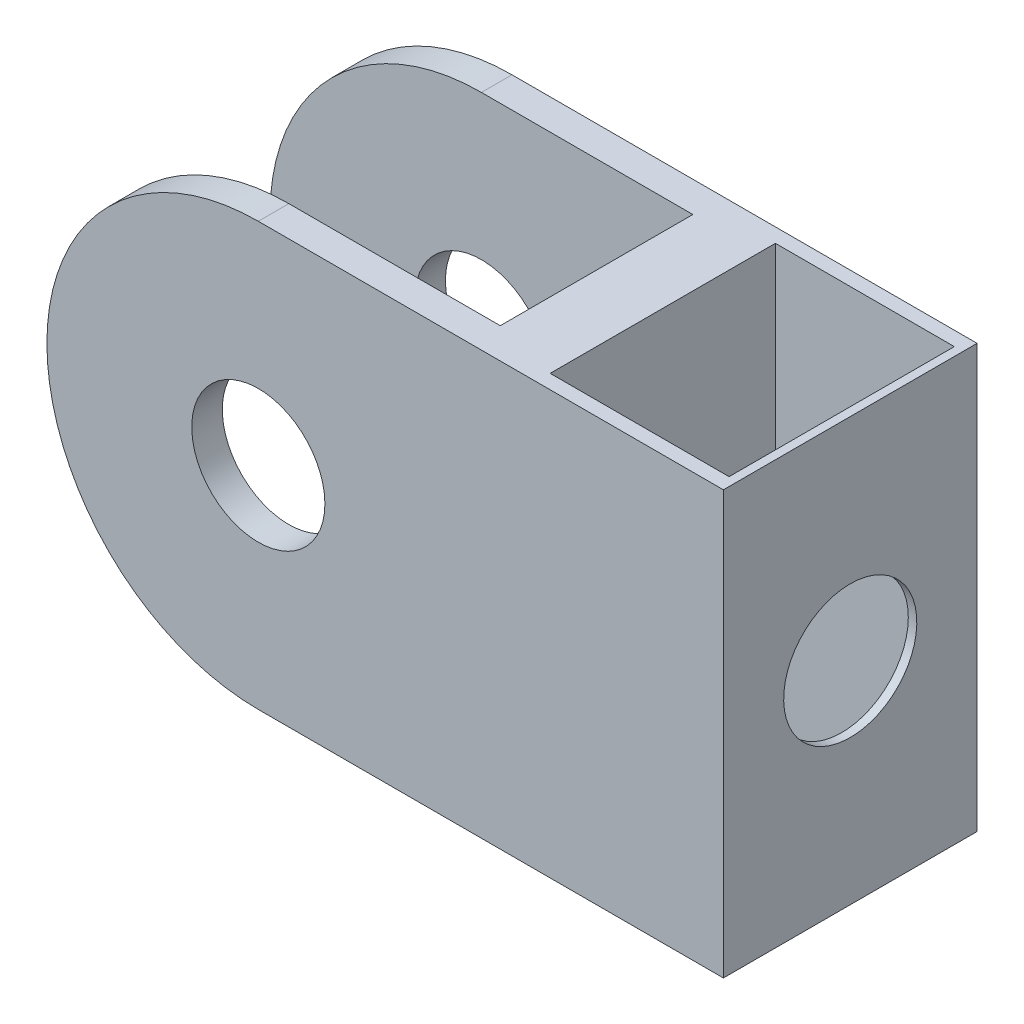
ISO-10303-21;
HEADER;
FILE_DESCRIPTION(('STEP AP214'),'2;1');
FILE_NAME('part.step','',(''),(''),'','','');
FILE_SCHEMA(('AUTOMOTIVE_DESIGN { 1 0 10303 214 1 1 1 1 }'));
ENDSEC;
DATA;
#1=APPLICATION_CONTEXT('core data for automotive mechanical design processes');
#2=APPLICATION_PROTOCOL_DEFINITION('international standard','automotive_design',2000,#1);
#3=PRODUCT_CONTEXT('',#1,'mechanical');
#4=PRODUCT('Part','Part','',(#3));
#5=PRODUCT_RELATED_PRODUCT_CATEGORY('part','',(#4));
#6=PRODUCT_DEFINITION_FORMATION('','',#4);
#7=PRODUCT_DEFINITION_CONTEXT('part definition',#1,'design');
#8=PRODUCT_DEFINITION('design','',#6,#7);
#9=PRODUCT_DEFINITION_SHAPE('','',#8);
#10=(LENGTH_UNIT() NAMED_UNIT(*) SI_UNIT(.MILLI.,.METRE.));
#11=(NAMED_UNIT(*) PLANE_ANGLE_UNIT() SI_UNIT($,.RADIAN.));
#12=(NAMED_UNIT(*) SI_UNIT($,.STERADIAN.) SOLID_ANGLE_UNIT());
#13=UNCERTAINTY_MEASURE_WITH_UNIT(LENGTH_MEASURE(1.E-05),#10,'distance_accuracy_value','');
#14=(GEOMETRIC_REPRESENTATION_CONTEXT(3) GLOBAL_UNCERTAINTY_ASSIGNED_CONTEXT((#13)) GLOBAL_UNIT_ASSIGNED_CONTEXT((#10,
#11,#12)) REPRESENTATION_CONTEXT('',''));
#15=CARTESIAN_POINT('',(0.,0.,0.));
#16=DIRECTION('',(0.,0.,1.));
#17=DIRECTION('',(1.,0.,0.));
#18=AXIS2_PLACEMENT_3D('',#15,#16,#17);
#19=CARTESIAN_POINT('',(0.,0.,15.24));
#20=DIRECTION('',(0.,0.,-1.));
#21=DIRECTION('',(-1.,0.,0.));
#22=AXIS2_PLACEMENT_3D('',#19,#20,#21);
#23=CYLINDRICAL_SURFACE('',#22,12.7);
#24=CARTESIAN_POINT('',(0.,0.,1.83515));
#25=DIRECTION('',(0.,0.,-1.));
#26=DIRECTION('',(-1.,0.,0.));
#27=AXIS2_PLACEMENT_3D('',#24,#25,#26);
#28=CIRCLE('',#27,12.7);
#29=CARTESIAN_POINT('',(0.,-12.7,1.83515));
#30=VERTEX_POINT('',#29);
#31=CARTESIAN_POINT('',(0.,12.7,1.83515));
#32=VERTEX_POINT('',#31);
#33=EDGE_CURVE('E195',#30,#32,#28,.T.);
#34=ORIENTED_EDGE('',*,*,#33,.T.);
#35=DIRECTION('',(0.,0.,-1.));
#36=VECTOR('',#35,1.);
#37=CARTESIAN_POINT('',(0.,12.7,15.24));
#38=LINE('',#37,#36);
#39=CARTESIAN_POINT('',(0.,12.7,0.));
#40=VERTEX_POINT('',#39);
#41=EDGE_CURVE('E214',#32,#40,#38,.T.);
#42=ORIENTED_EDGE('',*,*,#41,.T.);
#43=CARTESIAN_POINT('',(0.,0.,0.));
#44=DIRECTION('',(0.,0.,1.));
#45=DIRECTION('',(1.,0.,0.));
#46=AXIS2_PLACEMENT_3D('',#43,#44,#45);
#47=CIRCLE('',#46,12.7);
#48=CARTESIAN_POINT('',(0.,-12.7,0.));
#49=VERTEX_POINT('',#48);
#50=EDGE_CURVE('E201',#40,#49,#47,.T.);
#51=ORIENTED_EDGE('',*,*,#50,.T.);
#52=DIRECTION('',(0.,0.,-1.));
#53=VECTOR('',#52,1.);
#54=CARTESIAN_POINT('',(0.,-12.7,15.24));
#55=LINE('',#54,#53);
#56=EDGE_CURVE('E48',#30,#49,#55,.T.);
#57=ORIENTED_EDGE('',*,*,#56,.F.);
#58=EDGE_LOOP('',(#34,#42,#51,#57));
#59=FACE_BOUND('',#58,.T.);
#60=ADVANCED_FACE('F39',(#59),#23,.T.);
#61=CARTESIAN_POINT('',(0.,0.,15.24));
#62=DIRECTION('',(0.,0.,-1.));
#63=DIRECTION('',(-1.,0.,0.));
#64=AXIS2_PLACEMENT_3D('',#61,#62,#63);
#65=CYLINDRICAL_SURFACE('',#64,4.);
#66=CARTESIAN_POINT('',(0.,0.,1.83515));
#67=DIRECTION('',(0.,0.,-1.));
#68=DIRECTION('',(-1.,0.,0.));
#69=AXIS2_PLACEMENT_3D('',#66,#67,#68);
#70=CIRCLE('',#69,4.);
#71=CARTESIAN_POINT('',(-4.,0.,1.83515));
#72=VERTEX_POINT('',#71);
#73=EDGE_CURVE('E194',#72,#72,#70,.T.);
#74=ORIENTED_EDGE('',*,*,#73,.F.);
#75=EDGE_LOOP('',(#74));
#76=FACE_BOUND('',#75,.T.);
#77=CARTESIAN_POINT('',(0.,0.,0.));
#78=DIRECTION('',(0.,0.,1.));
#79=DIRECTION('',(1.,0.,0.));
#80=AXIS2_PLACEMENT_3D('',#77,#78,#79);
#81=CIRCLE('',#80,4.);
#82=CARTESIAN_POINT('',(4.,0.,0.));
#83=VERTEX_POINT('',#82);
#84=EDGE_CURVE('E197',#83,#83,#81,.T.);
#85=ORIENTED_EDGE('',*,*,#84,.F.);
#86=EDGE_LOOP('',(#85));
#87=FACE_BOUND('',#86,.T.);
#88=ADVANCED_FACE('F239',(#76,#87),#65,.F.);
#89=CARTESIAN_POINT('',(0.,0.,15.24));
#90=DIRECTION('',(0.,0.,1.));
#91=DIRECTION('',(1.,0.,0.));
#92=AXIS2_PLACEMENT_3D('',#89,#90,#91);
#93=PLANE('',#92);
#94=CARTESIAN_POINT('',(0.,0.,15.24));
#95=DIRECTION('',(0.,0.,1.));
#96=DIRECTION('',(1.,0.,0.));
#97=AXIS2_PLACEMENT_3D('',#94,#95,#96);
#98=CIRCLE('',#97,12.7);
#99=CARTESIAN_POINT('',(0.,12.7,15.24));
#100=VERTEX_POINT('',#99);
#101=CARTESIAN_POINT('',(0.,-12.7,15.24));
#102=VERTEX_POINT('',#101);
#103=EDGE_CURVE('E204',#100,#102,#98,.T.);
#104=ORIENTED_EDGE('',*,*,#103,.T.);
#105=DIRECTION('',(1.,0.,0.));
#106=VECTOR('',#105,1.);
#107=CARTESIAN_POINT('',(0.,-12.7,15.24));
#108=LINE('',#107,#106);
#109=CARTESIAN_POINT('',(27.94,-12.7,15.24));
#110=VERTEX_POINT('',#109);
#111=EDGE_CURVE('E207',#102,#110,#108,.T.);
#112=ORIENTED_EDGE('',*,*,#111,.T.);
#113=DIRECTION('',(0.,1.,0.));
#114=VECTOR('',#113,1.);
#115=CARTESIAN_POINT('',(27.94,12.7,15.24));
#116=LINE('',#115,#114);
#117=CARTESIAN_POINT('',(27.94,12.7,15.24));
#118=VERTEX_POINT('',#117);
#119=EDGE_CURVE('E210',#110,#118,#116,.T.);
#120=ORIENTED_EDGE('',*,*,#119,.T.);
#121=DIRECTION('',(-1.,0.,0.));
#122=VECTOR('',#121,1.);
#123=CARTESIAN_POINT('',(0.,12.7,15.24));
#124=LINE('',#123,#122);
#125=EDGE_CURVE('E212',#118,#100,#124,.T.);
#126=ORIENTED_EDGE('',*,*,#125,.T.);
#127=EDGE_LOOP('',(#104,#112,#120,#126));
#128=FACE_BOUND('',#127,.T.);
#129=CARTESIAN_POINT('',(0.,0.,15.24));
#130=DIRECTION('',(0.,0.,1.));
#131=DIRECTION('',(1.,0.,0.));
#132=AXIS2_PLACEMENT_3D('',#129,#130,#131);
#133=CIRCLE('',#132,4.);
#134=CARTESIAN_POINT('',(4.,0.,15.24));
#135=VERTEX_POINT('',#134);
#136=EDGE_CURVE('E198',#135,#135,#133,.T.);
#137=ORIENTED_EDGE('',*,*,#136,.F.);
#138=EDGE_LOOP('',(#137));
#139=FACE_BOUND('',#138,.T.);
#140=ADVANCED_FACE('F242',(#128,#139),#93,.T.);
#141=CARTESIAN_POINT('',(0.,0.,0.));
#142=DIRECTION('',(0.,0.,1.));
#143=DIRECTION('',(1.,0.,0.));
#144=AXIS2_PLACEMENT_3D('',#141,#142,#143);
#145=PLANE('',#144);
#146=ORIENTED_EDGE('',*,*,#50,.F.);
#147=DIRECTION('',(-1.,0.,0.));
#148=VECTOR('',#147,1.);
#149=CARTESIAN_POINT('',(0.,12.7,0.));
#150=LINE('',#149,#148);
#151=CARTESIAN_POINT('',(27.94,12.7,0.));
#152=VERTEX_POINT('',#151);
#153=EDGE_CURVE('E208',#152,#40,#150,.T.);
#154=ORIENTED_EDGE('',*,*,#153,.F.);
#155=DIRECTION('',(0.,1.,0.));
#156=VECTOR('',#155,1.);
#157=CARTESIAN_POINT('',(27.94,12.7,0.));
#158=LINE('',#157,#156);
#159=CARTESIAN_POINT('',(27.94,-12.7,0.));
#160=VERTEX_POINT('',#159);
#161=EDGE_CURVE('E219',#160,#152,#158,.T.);
#162=ORIENTED_EDGE('',*,*,#161,.F.);
#163=DIRECTION('',(1.,0.,0.));
#164=VECTOR('',#163,1.);
#165=CARTESIAN_POINT('',(0.,-12.7,0.));
#166=LINE('',#165,#164);
#167=EDGE_CURVE('E217',#49,#160,#166,.T.);
#168=ORIENTED_EDGE('',*,*,#167,.F.);
#169=EDGE_LOOP('',(#146,#154,#162,#168));
#170=FACE_BOUND('',#169,.T.);
#171=ORIENTED_EDGE('',*,*,#84,.T.);
#172=EDGE_LOOP('',(#171));
#173=FACE_BOUND('',#172,.T.);
#174=ADVANCED_FACE('F247',(#170,#173),#145,.F.);
#175=CARTESIAN_POINT('',(0.,12.7,13.40485));
#176=VERTEX_POINT('',#175);
#177=EDGE_CURVE('E223',#100,#176,#38,.T.);
#178=ORIENTED_EDGE('',*,*,#177,.T.);
#179=CARTESIAN_POINT('',(0.,0.,13.40485));
#180=DIRECTION('',(0.,0.,1.));
#181=DIRECTION('',(1.,0.,0.));
#182=AXIS2_PLACEMENT_3D('',#179,#180,#181);
#183=CIRCLE('',#182,12.7);
#184=CARTESIAN_POINT('',(0.,-12.7,13.40485));
#185=VERTEX_POINT('',#184);
#186=EDGE_CURVE('E192',#176,#185,#183,.T.);
#187=ORIENTED_EDGE('',*,*,#186,.T.);
#188=EDGE_CURVE('E11',#102,#185,#55,.T.);
#189=ORIENTED_EDGE('',*,*,#188,.F.);
#190=ORIENTED_EDGE('',*,*,#103,.F.);
#191=EDGE_LOOP('',(#178,#187,#189,#190));
#192=FACE_BOUND('',#191,.T.);
#193=ADVANCED_FACE('F41',(#192),#23,.T.);
#194=CARTESIAN_POINT('',(0.,-12.7,15.24));
#195=DIRECTION('',(0.,1.,0.));
#196=DIRECTION('',(0.,0.,1.));
#197=AXIS2_PLACEMENT_3D('',#194,#195,#196);
#198=PLANE('',#197);
#199=DIRECTION('',(1.,0.,0.));
#200=VECTOR('',#199,1.);
#201=CARTESIAN_POINT('',(16.6780231875329,-12.7,14.3854871721803));
#202=LINE('',#201,#200);
#203=CARTESIAN_POINT('',(16.6780231875329,-12.7,14.3854871721803));
#204=VERTEX_POINT('',#203);
#205=CARTESIAN_POINT('',(27.4280759775184,-12.7,14.3854871721803));
#206=VERTEX_POINT('',#205);
#207=EDGE_CURVE('E138',#204,#206,#202,.T.);
#208=ORIENTED_EDGE('',*,*,#207,.T.);
#209=DIRECTION('',(0.,0.,-1.));
#210=VECTOR('',#209,1.);
#211=CARTESIAN_POINT('',(27.4280759775184,-12.7,14.3854871721803));
#212=LINE('',#211,#210);
#213=CARTESIAN_POINT('',(27.4280759775184,-12.7,0.854512827819676));
#214=VERTEX_POINT('',#213);
#215=EDGE_CURVE('E132',#206,#214,#212,.T.);
#216=ORIENTED_EDGE('',*,*,#215,.T.);
#217=DIRECTION('',(-1.,0.,0.));
#218=VECTOR('',#217,1.);
#219=CARTESIAN_POINT('',(16.6780231875329,-12.7,0.854512827819676));
#220=LINE('',#219,#218);
#221=CARTESIAN_POINT('',(16.6780231875329,-12.7,0.854512827819676));
#222=VERTEX_POINT('',#221);
#223=EDGE_CURVE('E141',#214,#222,#220,.T.);
#224=ORIENTED_EDGE('',*,*,#223,.T.);
#225=DIRECTION('',(0.,0.,1.));
#226=VECTOR('',#225,1.);
#227=CARTESIAN_POINT('',(16.6780231875329,-12.7,14.3854871721803));
#228=LINE('',#227,#226);
#229=EDGE_CURVE('E56',#222,#204,#228,.T.);
#230=ORIENTED_EDGE('',*,*,#229,.T.);
#231=EDGE_LOOP('',(#208,#216,#224,#230));
#232=FACE_BOUND('',#231,.T.);
#233=DIRECTION('',(0.,0.,-1.));
#234=VECTOR('',#233,1.);
#235=CARTESIAN_POINT('',(12.7,-12.7,1.83515));
#236=LINE('',#235,#234);
#237=CARTESIAN_POINT('',(12.7,-12.7,13.40485));
#238=VERTEX_POINT('',#237);
#239=CARTESIAN_POINT('',(12.7,-12.7,1.83515));
#240=VERTEX_POINT('',#239);
#241=EDGE_CURVE('E173',#238,#240,#236,.T.);
#242=ORIENTED_EDGE('',*,*,#241,.T.);
#243=DIRECTION('',(-1.,0.,0.));
#244=VECTOR('',#243,1.);
#245=CARTESIAN_POINT('',(-12.7,-12.7,1.83515));
#246=LINE('',#245,#244);
#247=EDGE_CURVE('E177',#240,#30,#246,.T.);
#248=ORIENTED_EDGE('',*,*,#247,.T.);
#249=ORIENTED_EDGE('',*,*,#56,.T.);
#250=ORIENTED_EDGE('',*,*,#167,.T.);
#251=DIRECTION('',(0.,0.,-1.));
#252=VECTOR('',#251,1.);
#253=CARTESIAN_POINT('',(27.94,-12.7,15.24));
#254=LINE('',#253,#252);
#255=EDGE_CURVE('E229',#110,#160,#254,.T.);
#256=ORIENTED_EDGE('',*,*,#255,.F.);
#257=ORIENTED_EDGE('',*,*,#111,.F.);
#258=ORIENTED_EDGE('',*,*,#188,.T.);
#259=DIRECTION('',(1.,0.,0.));
#260=VECTOR('',#259,1.);
#261=CARTESIAN_POINT('',(-12.7,-12.7,13.40485));
#262=LINE('',#261,#260);
#263=EDGE_CURVE('E170',#185,#238,#262,.T.);
#264=ORIENTED_EDGE('',*,*,#263,.T.);
#265=EDGE_LOOP('',(#242,#248,#249,#250,#256,#257,#258,#264));
#266=FACE_BOUND('',#265,.T.);
#267=ADVANCED_FACE('F145',(#232,#266),#198,.F.);
#268=CARTESIAN_POINT('',(27.94,12.7,15.24));
#269=DIRECTION('',(-1.,0.,0.));
#270=DIRECTION('',(0.,-1.,0.));
#271=AXIS2_PLACEMENT_3D('',#268,#269,#270);
#272=PLANE('',#271);
#273=CARTESIAN_POINT('',(27.94,0.,7.62));
#274=DIRECTION('',(1.,0.,0.));
#275=DIRECTION('',(0.,1.,0.));
#276=AXIS2_PLACEMENT_3D('',#273,#274,#275);
#277=CIRCLE('',#276,4.);
#278=CARTESIAN_POINT('',(27.94,4.,7.62));
#279=VERTEX_POINT('',#278);
#280=EDGE_CURVE('E415',#279,#279,#277,.T.);
#281=ORIENTED_EDGE('',*,*,#280,.F.);
#282=EDGE_LOOP('',(#281));
#283=FACE_BOUND('',#282,.T.);
#284=ORIENTED_EDGE('',*,*,#161,.T.);
#285=DIRECTION('',(0.,0.,-1.));
#286=VECTOR('',#285,1.);
#287=CARTESIAN_POINT('',(27.94,12.7,15.24));
#288=LINE('',#287,#286);
#289=EDGE_CURVE('E226',#118,#152,#288,.T.);
#290=ORIENTED_EDGE('',*,*,#289,.F.);
#291=ORIENTED_EDGE('',*,*,#119,.F.);
#292=ORIENTED_EDGE('',*,*,#255,.T.);
#293=EDGE_LOOP('',(#284,#290,#291,#292));
#294=FACE_BOUND('',#293,.T.);
#295=ADVANCED_FACE('F279',(#283,#294),#272,.F.);
#296=CARTESIAN_POINT('',(0.,12.7,15.24));
#297=DIRECTION('',(0.,-1.,0.));
#298=DIRECTION('',(0.,0.,-1.));
#299=AXIS2_PLACEMENT_3D('',#296,#297,#298);
#300=PLANE('',#299);
#301=DIRECTION('',(-1.,0.,0.));
#302=VECTOR('',#301,1.);
#303=CARTESIAN_POINT('',(16.6780231875329,12.7,0.854512827819676));
#304=LINE('',#303,#302);
#305=CARTESIAN_POINT('',(27.4280759775184,12.7,0.854512827819676));
#306=VERTEX_POINT('',#305);
#307=CARTESIAN_POINT('',(16.6780231875329,12.7,0.854512827819676));
#308=VERTEX_POINT('',#307);
#309=EDGE_CURVE('E160',#306,#308,#304,.T.);
#310=ORIENTED_EDGE('',*,*,#309,.F.);
#311=DIRECTION('',(0.,0.,-1.));
#312=VECTOR('',#311,1.);
#313=CARTESIAN_POINT('',(27.4280759775184,12.7,14.3854871721803));
#314=LINE('',#313,#312);
#315=CARTESIAN_POINT('',(27.4280759775184,12.7,14.3854871721803));
#316=VERTEX_POINT('',#315);
#317=EDGE_CURVE('E64',#316,#306,#314,.T.);
#318=ORIENTED_EDGE('',*,*,#317,.F.);
#319=DIRECTION('',(1.,0.,0.));
#320=VECTOR('',#319,1.);
#321=CARTESIAN_POINT('',(16.6780231875329,12.7,14.3854871721803));
#322=LINE('',#321,#320);
#323=CARTESIAN_POINT('',(16.6780231875329,12.7,14.3854871721803));
#324=VERTEX_POINT('',#323);
#325=EDGE_CURVE('E148',#324,#316,#322,.T.);
#326=ORIENTED_EDGE('',*,*,#325,.F.);
#327=DIRECTION('',(0.,0.,1.));
#328=VECTOR('',#327,1.);
#329=CARTESIAN_POINT('',(16.6780231875329,12.7,14.3854871721803));
#330=LINE('',#329,#328);
#331=EDGE_CURVE('E151',#308,#324,#330,.T.);
#332=ORIENTED_EDGE('',*,*,#331,.F.);
#333=EDGE_LOOP('',(#310,#318,#326,#332));
#334=FACE_BOUND('',#333,.T.);
#335=ORIENTED_EDGE('',*,*,#41,.F.);
#336=DIRECTION('',(-1.,0.,0.));
#337=VECTOR('',#336,1.);
#338=CARTESIAN_POINT('',(-12.7,12.7,1.83515));
#339=LINE('',#338,#337);
#340=CARTESIAN_POINT('',(12.7,12.7,1.83515));
#341=VERTEX_POINT('',#340);
#342=EDGE_CURVE('E174',#341,#32,#339,.T.);
#343=ORIENTED_EDGE('',*,*,#342,.F.);
#344=DIRECTION('',(0.,0.,-1.));
#345=VECTOR('',#344,1.);
#346=CARTESIAN_POINT('',(12.7,12.7,1.83515));
#347=LINE('',#346,#345);
#348=CARTESIAN_POINT('',(12.7,12.7,13.40485));
#349=VERTEX_POINT('',#348);
#350=EDGE_CURVE('E182',#349,#341,#347,.T.);
#351=ORIENTED_EDGE('',*,*,#350,.F.);
#352=DIRECTION('',(1.,0.,0.));
#353=VECTOR('',#352,1.);
#354=CARTESIAN_POINT('',(-12.7,12.7,13.40485));
#355=LINE('',#354,#353);
#356=EDGE_CURVE('E166',#176,#349,#355,.T.);
#357=ORIENTED_EDGE('',*,*,#356,.F.);
#358=ORIENTED_EDGE('',*,*,#177,.F.);
#359=ORIENTED_EDGE('',*,*,#125,.F.);
#360=ORIENTED_EDGE('',*,*,#289,.T.);
#361=ORIENTED_EDGE('',*,*,#153,.T.);
#362=EDGE_LOOP('',(#335,#343,#351,#357,#358,#359,#360,#361));
#363=FACE_BOUND('',#362,.T.);
#364=ADVANCED_FACE('F270',(#334,#363),#300,.F.);
#365=CARTESIAN_POINT('',(0.,0.,13.40485));
#366=DIRECTION('',(0.,0.,1.));
#367=DIRECTION('',(1.,0.,0.));
#368=AXIS2_PLACEMENT_3D('',#365,#366,#367);
#369=CIRCLE('',#368,4.);
#370=CARTESIAN_POINT('',(4.,0.,13.40485));
#371=VERTEX_POINT('',#370);
#372=EDGE_CURVE('E189',#371,#371,#369,.T.);
#373=ORIENTED_EDGE('',*,*,#372,.F.);
#374=EDGE_LOOP('',(#373));
#375=FACE_BOUND('',#374,.T.);
#376=ORIENTED_EDGE('',*,*,#136,.T.);
#377=EDGE_LOOP('',(#376));
#378=FACE_BOUND('',#377,.T.);
#379=ADVANCED_FACE('F244',(#375,#378),#65,.F.);
#380=CARTESIAN_POINT('',(-12.7,-12.7,1.83515));
#381=DIRECTION('',(0.,0.,-1.));
#382=DIRECTION('',(-1.,0.,0.));
#383=AXIS2_PLACEMENT_3D('',#380,#381,#382);
#384=PLANE('',#383);
#385=ORIENTED_EDGE('',*,*,#73,.T.);
#386=EDGE_LOOP('',(#385));
#387=FACE_BOUND('',#386,.T.);
#388=ORIENTED_EDGE('',*,*,#33,.F.);
#389=ORIENTED_EDGE('',*,*,#247,.F.);
#390=DIRECTION('',(0.,1.,0.));
#391=VECTOR('',#390,1.);
#392=CARTESIAN_POINT('',(12.7,-12.7,1.83515));
#393=LINE('',#392,#391);
#394=EDGE_CURVE('E187',#240,#341,#393,.T.);
#395=ORIENTED_EDGE('',*,*,#394,.T.);
#396=ORIENTED_EDGE('',*,*,#342,.T.);
#397=EDGE_LOOP('',(#388,#389,#395,#396));
#398=FACE_BOUND('',#397,.T.);
#399=ADVANCED_FACE('F236',(#387,#398),#384,.F.);
#400=CARTESIAN_POINT('',(-12.7,-12.7,13.40485));
#401=DIRECTION('',(0.,0.,1.));
#402=DIRECTION('',(1.,0.,0.));
#403=AXIS2_PLACEMENT_3D('',#400,#401,#402);
#404=PLANE('',#403);
#405=ORIENTED_EDGE('',*,*,#372,.T.);
#406=EDGE_LOOP('',(#405));
#407=FACE_BOUND('',#406,.T.);
#408=ORIENTED_EDGE('',*,*,#356,.T.);
#409=DIRECTION('',(0.,1.,0.));
#410=VECTOR('',#409,1.);
#411=CARTESIAN_POINT('',(12.7,-12.7,13.40485));
#412=LINE('',#411,#410);
#413=EDGE_CURVE('E180',#238,#349,#412,.T.);
#414=ORIENTED_EDGE('',*,*,#413,.F.);
#415=ORIENTED_EDGE('',*,*,#263,.F.);
#416=ORIENTED_EDGE('',*,*,#186,.F.);
#417=EDGE_LOOP('',(#408,#414,#415,#416));
#418=FACE_BOUND('',#417,.T.);
#419=ADVANCED_FACE('F287',(#407,#418),#404,.F.);
#420=CARTESIAN_POINT('',(12.7,-12.7,1.83515));
#421=DIRECTION('',(1.,0.,0.));
#422=DIRECTION('',(0.,0.,-1.));
#423=AXIS2_PLACEMENT_3D('',#420,#421,#422);
#424=PLANE('',#423);
#425=CARTESIAN_POINT('',(12.7,0.,7.62));
#426=DIRECTION('',(1.,0.,0.));
#427=DIRECTION('',(0.,0.,-1.));
#428=AXIS2_PLACEMENT_3D('',#425,#426,#427);
#429=CIRCLE('',#428,4.);
#430=CARTESIAN_POINT('',(12.7,0.,3.62));
#431=VERTEX_POINT('',#430);
#432=EDGE_CURVE('E154',#431,#431,#429,.T.);
#433=ORIENTED_EDGE('',*,*,#432,.T.);
#434=EDGE_LOOP('',(#433));
#435=FACE_BOUND('',#434,.T.);
#436=ORIENTED_EDGE('',*,*,#350,.T.);
#437=ORIENTED_EDGE('',*,*,#394,.F.);
#438=ORIENTED_EDGE('',*,*,#241,.F.);
#439=ORIENTED_EDGE('',*,*,#413,.T.);
#440=EDGE_LOOP('',(#436,#437,#438,#439));
#441=FACE_BOUND('',#440,.T.);
#442=ADVANCED_FACE('F290',(#435,#441),#424,.F.);
#443=CARTESIAN_POINT('',(27.4280759775184,-12.7,14.3854871721803));
#444=DIRECTION('',(1.,0.,0.));
#445=DIRECTION('',(0.,0.,-1.));
#446=AXIS2_PLACEMENT_3D('',#443,#444,#445);
#447=PLANE('',#446);
#448=CARTESIAN_POINT('',(27.4280759775184,0.,7.62));
#449=DIRECTION('',(1.,0.,0.));
#450=DIRECTION('',(0.,0.,-1.));
#451=AXIS2_PLACEMENT_3D('',#448,#449,#450);
#452=CIRCLE('',#451,4.);
#453=CARTESIAN_POINT('',(27.4280759775184,0.,3.62));
#454=VERTEX_POINT('',#453);
#455=EDGE_CURVE('E418',#454,#454,#452,.T.);
#456=ORIENTED_EDGE('',*,*,#455,.T.);
#457=EDGE_LOOP('',(#456));
#458=FACE_BOUND('',#457,.T.);
#459=ORIENTED_EDGE('',*,*,#317,.T.);
#460=DIRECTION('',(0.,1.,0.));
#461=VECTOR('',#460,1.);
#462=CARTESIAN_POINT('',(27.4280759775184,-12.7,0.854512827819676));
#463=LINE('',#462,#461);
#464=EDGE_CURVE('E128',#214,#306,#463,.T.);
#465=ORIENTED_EDGE('',*,*,#464,.F.);
#466=ORIENTED_EDGE('',*,*,#215,.F.);
#467=DIRECTION('',(0.,1.,0.));
#468=VECTOR('',#467,1.);
#469=CARTESIAN_POINT('',(27.4280759775184,-12.7,14.3854871721803));
#470=LINE('',#469,#468);
#471=EDGE_CURVE('E164',#206,#316,#470,.T.);
#472=ORIENTED_EDGE('',*,*,#471,.T.);
#473=EDGE_LOOP('',(#459,#465,#466,#472));
#474=FACE_BOUND('',#473,.T.);
#475=ADVANCED_FACE('F130',(#458,#474),#447,.F.);
#476=CARTESIAN_POINT('',(16.6780231875329,-12.7,14.3854871721803));
#477=DIRECTION('',(0.,0.,1.));
#478=DIRECTION('',(1.,0.,0.));
#479=AXIS2_PLACEMENT_3D('',#476,#477,#478);
#480=PLANE('',#479);
#481=ORIENTED_EDGE('',*,*,#325,.T.);
#482=ORIENTED_EDGE('',*,*,#471,.F.);
#483=ORIENTED_EDGE('',*,*,#207,.F.);
#484=DIRECTION('',(0.,1.,0.));
#485=VECTOR('',#484,1.);
#486=CARTESIAN_POINT('',(16.6780231875329,-12.7,14.3854871721803));
#487=LINE('',#486,#485);
#488=EDGE_CURVE('E167',#204,#324,#487,.T.);
#489=ORIENTED_EDGE('',*,*,#488,.T.);
#490=EDGE_LOOP('',(#481,#482,#483,#489));
#491=FACE_BOUND('',#490,.T.);
#492=ADVANCED_FACE('F298',(#491),#480,.F.);
#493=CARTESIAN_POINT('',(16.6780231875329,-12.7,14.3854871721803));
#494=DIRECTION('',(-1.,0.,0.));
#495=DIRECTION('',(0.,0.,1.));
#496=AXIS2_PLACEMENT_3D('',#493,#494,#495);
#497=PLANE('',#496);
#498=CARTESIAN_POINT('',(16.6780231875329,0.,7.62));
#499=DIRECTION('',(-1.,0.,0.));
#500=DIRECTION('',(0.,0.,1.));
#501=AXIS2_PLACEMENT_3D('',#498,#499,#500);
#502=CIRCLE('',#501,4.);
#503=CARTESIAN_POINT('',(16.6780231875329,0.,11.62));
#504=VERTEX_POINT('',#503);
#505=EDGE_CURVE('E43',#504,#504,#502,.T.);
#506=ORIENTED_EDGE('',*,*,#505,.T.);
#507=EDGE_LOOP('',(#506));
#508=FACE_BOUND('',#507,.T.);
#509=ORIENTED_EDGE('',*,*,#331,.T.);
#510=ORIENTED_EDGE('',*,*,#488,.F.);
#511=ORIENTED_EDGE('',*,*,#229,.F.);
#512=DIRECTION('',(0.,1.,0.));
#513=VECTOR('',#512,1.);
#514=CARTESIAN_POINT('',(16.6780231875329,-12.7,0.854512827819676));
#515=LINE('',#514,#513);
#516=EDGE_CURVE('E137',#222,#308,#515,.T.);
#517=ORIENTED_EDGE('',*,*,#516,.T.);
#518=EDGE_LOOP('',(#509,#510,#511,#517));
#519=FACE_BOUND('',#518,.T.);
#520=ADVANCED_FACE('F366',(#508,#519),#497,.F.);
#521=CARTESIAN_POINT('',(16.6780231875329,-12.7,0.854512827819676));
#522=DIRECTION('',(0.,0.,-1.));
#523=DIRECTION('',(-1.,0.,0.));
#524=AXIS2_PLACEMENT_3D('',#521,#522,#523);
#525=PLANE('',#524);
#526=ORIENTED_EDGE('',*,*,#309,.T.);
#527=ORIENTED_EDGE('',*,*,#516,.F.);
#528=ORIENTED_EDGE('',*,*,#223,.F.);
#529=ORIENTED_EDGE('',*,*,#464,.T.);
#530=EDGE_LOOP('',(#526,#527,#528,#529));
#531=FACE_BOUND('',#530,.T.);
#532=ADVANCED_FACE('F142',(#531),#525,.F.);
#533=CARTESIAN_POINT('',(-12.7,0.,7.62));
#534=DIRECTION('',(1.,0.,0.));
#535=DIRECTION('',(0.,1.,0.));
#536=AXIS2_PLACEMENT_3D('',#533,#534,#535);
#537=CYLINDRICAL_SURFACE('',#536,4.);
#538=ORIENTED_EDGE('',*,*,#505,.F.);
#539=EDGE_LOOP('',(#538));
#540=FACE_BOUND('',#539,.T.);
#541=ORIENTED_EDGE('',*,*,#432,.F.);
#542=EDGE_LOOP('',(#541));
#543=FACE_BOUND('',#542,.T.);
#544=ADVANCED_FACE('F365',(#540,#543),#537,.F.);
#545=ORIENTED_EDGE('',*,*,#280,.T.);
#546=EDGE_LOOP('',(#545));
#547=FACE_BOUND('',#546,.T.);
#548=ORIENTED_EDGE('',*,*,#455,.F.);
#549=EDGE_LOOP('',(#548));
#550=FACE_BOUND('',#549,.T.);
#551=ADVANCED_FACE('F397',(#547,#550),#537,.F.);
#552=CLOSED_SHELL('',(#60,#88,#140,#174,#193,#267,#295,#364,#379,#399,#419,#442,#475,#492,#520,
#532,#544,#551));
#553=MANIFOLD_SOLID_BREP('B2',#552);
#554=ADVANCED_BREP_SHAPE_REPRESENTATION('',(#18,#553),#14);
#555=SHAPE_DEFINITION_REPRESENTATION(#9,#554);
ENDSEC;
END-ISO-10303-21;
